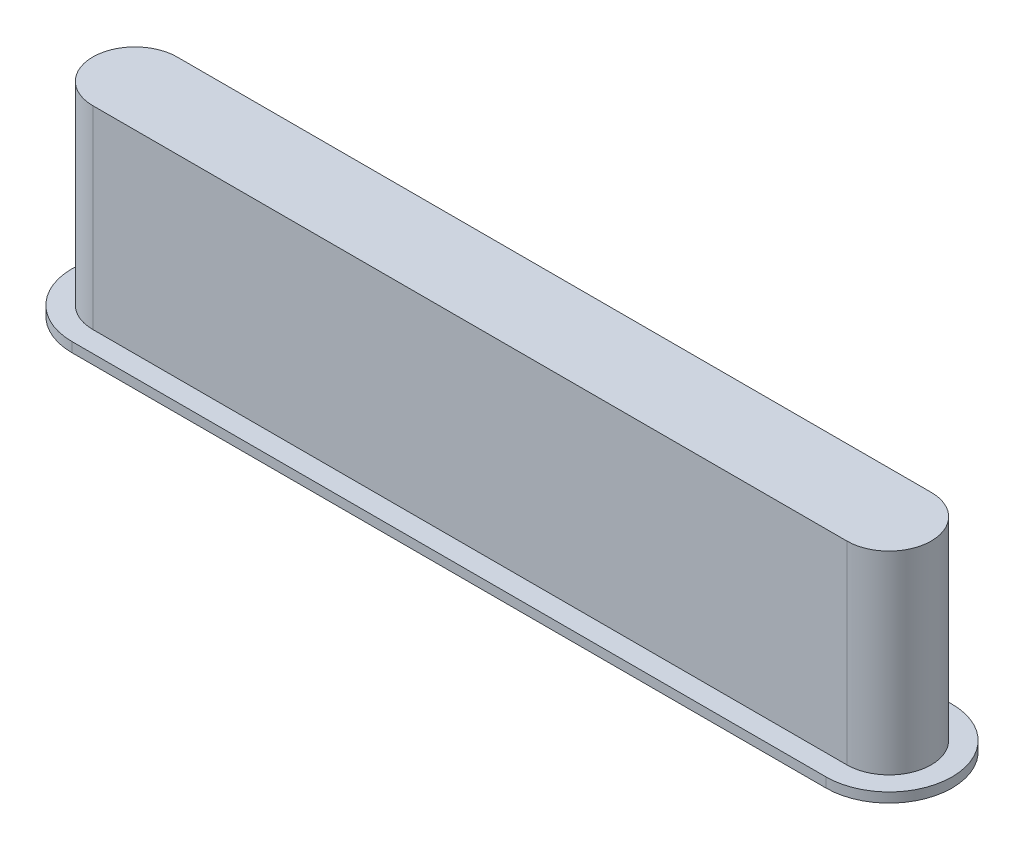
ISO-10303-21;
HEADER;
FILE_DESCRIPTION(('STEP AP214'),'2;1');
FILE_NAME('part.step','',(''),(''),'','','');
FILE_SCHEMA(('AUTOMOTIVE_DESIGN { 1 0 10303 214 1 1 1 1 }'));
ENDSEC;
DATA;
#1=APPLICATION_CONTEXT('core data for automotive mechanical design processes');
#2=APPLICATION_PROTOCOL_DEFINITION('international standard','automotive_design',2000,#1);
#3=PRODUCT_CONTEXT('',#1,'mechanical');
#4=PRODUCT('Part','Part','',(#3));
#5=PRODUCT_RELATED_PRODUCT_CATEGORY('part','',(#4));
#6=PRODUCT_DEFINITION_FORMATION('','',#4);
#7=PRODUCT_DEFINITION_CONTEXT('part definition',#1,'design');
#8=PRODUCT_DEFINITION('design','',#6,#7);
#9=PRODUCT_DEFINITION_SHAPE('','',#8);
#10=(LENGTH_UNIT() NAMED_UNIT(*) SI_UNIT(.MILLI.,.METRE.));
#11=(NAMED_UNIT(*) PLANE_ANGLE_UNIT() SI_UNIT($,.RADIAN.));
#12=(NAMED_UNIT(*) SI_UNIT($,.STERADIAN.) SOLID_ANGLE_UNIT());
#13=UNCERTAINTY_MEASURE_WITH_UNIT(LENGTH_MEASURE(1.E-05),#10,'distance_accuracy_value','');
#14=(GEOMETRIC_REPRESENTATION_CONTEXT(3) GLOBAL_UNCERTAINTY_ASSIGNED_CONTEXT((#13)) GLOBAL_UNIT_ASSIGNED_CONTEXT((#10,
#11,#12)) REPRESENTATION_CONTEXT('',''));
#15=CARTESIAN_POINT('',(0.,0.,0.));
#16=DIRECTION('',(0.,0.,1.));
#17=DIRECTION('',(1.,0.,0.));
#18=AXIS2_PLACEMENT_3D('',#15,#16,#17);
#19=CARTESIAN_POINT('',(-9.8806,5.08,0.));
#20=DIRECTION('',(0.,-1.,0.));
#21=DIRECTION('',(0.,0.,-1.));
#22=AXIS2_PLACEMENT_3D('',#19,#20,#21);
#23=CYLINDRICAL_SURFACE('',#22,1.1049);
#24=CARTESIAN_POINT('',(-9.8806,0.,0.));
#25=DIRECTION('',(0.,1.,0.));
#26=DIRECTION('',(0.,0.,1.));
#27=AXIS2_PLACEMENT_3D('',#24,#25,#26);
#28=CIRCLE('',#27,1.1049);
#29=CARTESIAN_POINT('',(-9.8806,0.,-1.1049));
#30=VERTEX_POINT('',#29);
#31=CARTESIAN_POINT('',(-9.8806,0.,1.1049));
#32=VERTEX_POINT('',#31);
#33=EDGE_CURVE('E138',#30,#32,#28,.T.);
#34=ORIENTED_EDGE('',*,*,#33,.T.);
#35=DIRECTION('',(0.,-1.,0.));
#36=VECTOR('',#35,1.);
#37=CARTESIAN_POINT('',(-9.8806,5.08,1.1049));
#38=LINE('',#37,#36);
#39=CARTESIAN_POINT('',(-9.8806,5.08,1.1049));
#40=VERTEX_POINT('',#39);
#41=EDGE_CURVE('E11',#40,#32,#38,.T.);
#42=ORIENTED_EDGE('',*,*,#41,.F.);
#43=CARTESIAN_POINT('',(-9.8806,5.08,0.));
#44=DIRECTION('',(0.,1.,0.));
#45=DIRECTION('',(0.,0.,1.));
#46=AXIS2_PLACEMENT_3D('',#43,#44,#45);
#47=CIRCLE('',#46,1.1049);
#48=CARTESIAN_POINT('',(-9.8806,5.08,-1.1049));
#49=VERTEX_POINT('',#48);
#50=EDGE_CURVE('E142',#49,#40,#47,.T.);
#51=ORIENTED_EDGE('',*,*,#50,.F.);
#52=DIRECTION('',(0.,-1.,0.));
#53=VECTOR('',#52,1.);
#54=CARTESIAN_POINT('',(-9.8806,5.08,-1.1049));
#55=LINE('',#54,#53);
#56=EDGE_CURVE('E150',#49,#30,#55,.T.);
#57=ORIENTED_EDGE('',*,*,#56,.T.);
#58=EDGE_LOOP('',(#34,#42,#51,#57));
#59=FACE_BOUND('',#58,.T.);
#60=ADVANCED_FACE('F39',(#59),#23,.T.);
#61=CARTESIAN_POINT('',(-9.8806,5.08,1.1049));
#62=DIRECTION('',(0.,0.,-1.));
#63=DIRECTION('',(-1.,0.,0.));
#64=AXIS2_PLACEMENT_3D('',#61,#62,#63);
#65=PLANE('',#64);
#66=DIRECTION('',(1.,0.,0.));
#67=VECTOR('',#66,1.);
#68=CARTESIAN_POINT('',(-9.8806,0.,1.1049));
#69=LINE('',#68,#67);
#70=CARTESIAN_POINT('',(9.8806,0.,1.1049));
#71=VERTEX_POINT('',#70);
#72=EDGE_CURVE('E153',#32,#71,#69,.T.);
#73=ORIENTED_EDGE('',*,*,#72,.T.);
#74=DIRECTION('',(0.,-1.,0.));
#75=VECTOR('',#74,1.);
#76=CARTESIAN_POINT('',(9.8806,5.08,1.1049));
#77=LINE('',#76,#75);
#78=CARTESIAN_POINT('',(9.8806,5.08,1.1049));
#79=VERTEX_POINT('',#78);
#80=EDGE_CURVE('E47',#79,#71,#77,.T.);
#81=ORIENTED_EDGE('',*,*,#80,.F.);
#82=DIRECTION('',(1.,0.,0.));
#83=VECTOR('',#82,1.);
#84=CARTESIAN_POINT('',(-9.8806,5.08,1.1049));
#85=LINE('',#84,#83);
#86=EDGE_CURVE('E144',#40,#79,#85,.T.);
#87=ORIENTED_EDGE('',*,*,#86,.F.);
#88=ORIENTED_EDGE('',*,*,#41,.T.);
#89=EDGE_LOOP('',(#73,#81,#87,#88));
#90=FACE_BOUND('',#89,.T.);
#91=ADVANCED_FACE('F173',(#90),#65,.F.);
#92=CARTESIAN_POINT('',(9.8806,5.08,0.));
#93=DIRECTION('',(0.,-1.,0.));
#94=DIRECTION('',(0.,0.,-1.));
#95=AXIS2_PLACEMENT_3D('',#92,#93,#94);
#96=CYLINDRICAL_SURFACE('',#95,1.1049);
#97=CARTESIAN_POINT('',(9.8806,0.,0.));
#98=DIRECTION('',(0.,1.,0.));
#99=DIRECTION('',(0.,0.,1.));
#100=AXIS2_PLACEMENT_3D('',#97,#98,#99);
#101=CIRCLE('',#100,1.1049);
#102=CARTESIAN_POINT('',(9.8806,0.,-1.1049));
#103=VERTEX_POINT('',#102);
#104=EDGE_CURVE('E156',#71,#103,#101,.T.);
#105=ORIENTED_EDGE('',*,*,#104,.T.);
#106=DIRECTION('',(0.,-1.,0.));
#107=VECTOR('',#106,1.);
#108=CARTESIAN_POINT('',(9.8806,5.08,-1.1049));
#109=LINE('',#108,#107);
#110=CARTESIAN_POINT('',(9.8806,5.08,-1.1049));
#111=VERTEX_POINT('',#110);
#112=EDGE_CURVE('E163',#111,#103,#109,.T.);
#113=ORIENTED_EDGE('',*,*,#112,.F.);
#114=CARTESIAN_POINT('',(9.8806,5.08,0.));
#115=DIRECTION('',(0.,1.,0.));
#116=DIRECTION('',(0.,0.,1.));
#117=AXIS2_PLACEMENT_3D('',#114,#115,#116);
#118=CIRCLE('',#117,1.1049);
#119=EDGE_CURVE('E147',#79,#111,#118,.T.);
#120=ORIENTED_EDGE('',*,*,#119,.F.);
#121=ORIENTED_EDGE('',*,*,#80,.T.);
#122=EDGE_LOOP('',(#105,#113,#120,#121));
#123=FACE_BOUND('',#122,.T.);
#124=ADVANCED_FACE('F169',(#123),#96,.T.);
#125=CARTESIAN_POINT('',(-9.8806,5.08,-1.1049));
#126=DIRECTION('',(0.,0.,1.));
#127=DIRECTION('',(1.,0.,0.));
#128=AXIS2_PLACEMENT_3D('',#125,#126,#127);
#129=PLANE('',#128);
#130=DIRECTION('',(-1.,0.,0.));
#131=VECTOR('',#130,1.);
#132=CARTESIAN_POINT('',(-9.8806,0.,-1.1049));
#133=LINE('',#132,#131);
#134=EDGE_CURVE('E145',#103,#30,#133,.T.);
#135=ORIENTED_EDGE('',*,*,#134,.T.);
#136=ORIENTED_EDGE('',*,*,#56,.F.);
#137=DIRECTION('',(-1.,0.,0.));
#138=VECTOR('',#137,1.);
#139=CARTESIAN_POINT('',(-9.8806,5.08,-1.1049));
#140=LINE('',#139,#138);
#141=EDGE_CURVE('E54',#111,#49,#140,.T.);
#142=ORIENTED_EDGE('',*,*,#141,.F.);
#143=ORIENTED_EDGE('',*,*,#112,.T.);
#144=EDGE_LOOP('',(#135,#136,#142,#143));
#145=FACE_BOUND('',#144,.T.);
#146=ADVANCED_FACE('F178',(#145),#129,.F.);
#147=CARTESIAN_POINT('',(-9.8806,5.08,0.));
#148=DIRECTION('',(0.,1.,0.));
#149=DIRECTION('',(0.,0.,1.));
#150=AXIS2_PLACEMENT_3D('',#147,#148,#149);
#151=PLANE('',#150);
#152=ORIENTED_EDGE('',*,*,#50,.T.);
#153=ORIENTED_EDGE('',*,*,#86,.T.);
#154=ORIENTED_EDGE('',*,*,#119,.T.);
#155=ORIENTED_EDGE('',*,*,#141,.T.);
#156=EDGE_LOOP('',(#152,#153,#154,#155));
#157=FACE_BOUND('',#156,.T.);
#158=ADVANCED_FACE('F181',(#157),#151,.T.);
#159=CARTESIAN_POINT('',(-9.8806,0.,0.));
#160=DIRECTION('',(0.,1.,0.));
#161=DIRECTION('',(0.,0.,1.));
#162=AXIS2_PLACEMENT_3D('',#159,#160,#161);
#163=PLANE('',#162);
#164=CARTESIAN_POINT('',(-9.8806,0.,0.));
#165=DIRECTION('',(0.,1.,0.));
#166=DIRECTION('',(0.,0.,1.));
#167=AXIS2_PLACEMENT_3D('',#164,#165,#166);
#168=CIRCLE('',#167,1.651);
#169=CARTESIAN_POINT('',(-9.8806,0.,-1.651));
#170=VERTEX_POINT('',#169);
#171=CARTESIAN_POINT('',(-9.8806,0.,1.651));
#172=VERTEX_POINT('',#171);
#173=EDGE_CURVE('E132',#170,#172,#168,.T.);
#174=ORIENTED_EDGE('',*,*,#173,.T.);
#175=DIRECTION('',(1.,0.,0.));
#176=VECTOR('',#175,1.);
#177=CARTESIAN_POINT('',(-9.8806,0.,1.651));
#178=LINE('',#177,#176);
#179=CARTESIAN_POINT('',(9.8806,0.,1.651));
#180=VERTEX_POINT('',#179);
#181=EDGE_CURVE('E104',#172,#180,#178,.T.);
#182=ORIENTED_EDGE('',*,*,#181,.T.);
#183=CARTESIAN_POINT('',(9.8806,0.,0.));
#184=DIRECTION('',(0.,1.,0.));
#185=DIRECTION('',(0.,0.,1.));
#186=AXIS2_PLACEMENT_3D('',#183,#184,#185);
#187=CIRCLE('',#186,1.651);
#188=CARTESIAN_POINT('',(9.8806,0.,-1.651));
#189=VERTEX_POINT('',#188);
#190=EDGE_CURVE('E127',#180,#189,#187,.T.);
#191=ORIENTED_EDGE('',*,*,#190,.T.);
#192=DIRECTION('',(-1.,0.,0.));
#193=VECTOR('',#192,1.);
#194=CARTESIAN_POINT('',(-9.8806,0.,-1.651));
#195=LINE('',#194,#193);
#196=EDGE_CURVE('E124',#189,#170,#195,.T.);
#197=ORIENTED_EDGE('',*,*,#196,.T.);
#198=EDGE_LOOP('',(#174,#182,#191,#197));
#199=FACE_BOUND('',#198,.T.);
#200=ORIENTED_EDGE('',*,*,#33,.F.);
#201=ORIENTED_EDGE('',*,*,#134,.F.);
#202=ORIENTED_EDGE('',*,*,#104,.F.);
#203=ORIENTED_EDGE('',*,*,#72,.F.);
#204=EDGE_LOOP('',(#200,#201,#202,#203));
#205=FACE_BOUND('',#204,.T.);
#206=ADVANCED_FACE('F176',(#199,#205),#163,.T.);
#207=CARTESIAN_POINT('',(-9.8806,-0.254,0.));
#208=DIRECTION('',(0.,1.,0.));
#209=DIRECTION('',(0.,0.,1.));
#210=AXIS2_PLACEMENT_3D('',#207,#208,#209);
#211=CYLINDRICAL_SURFACE('',#210,1.651);
#212=ORIENTED_EDGE('',*,*,#173,.F.);
#213=DIRECTION('',(0.,1.,0.));
#214=VECTOR('',#213,1.);
#215=CARTESIAN_POINT('',(-9.8806,-0.254,-1.651));
#216=LINE('',#215,#214);
#217=CARTESIAN_POINT('',(-9.8806,-0.254,-1.651));
#218=VERTEX_POINT('',#217);
#219=EDGE_CURVE('E123',#218,#170,#216,.T.);
#220=ORIENTED_EDGE('',*,*,#219,.F.);
#221=CARTESIAN_POINT('',(-9.8806,-0.254,0.));
#222=DIRECTION('',(0.,1.,0.));
#223=DIRECTION('',(0.,0.,1.));
#224=AXIS2_PLACEMENT_3D('',#221,#222,#223);
#225=CIRCLE('',#224,1.651);
#226=CARTESIAN_POINT('',(-9.8806,-0.254,1.651));
#227=VERTEX_POINT('',#226);
#228=EDGE_CURVE('E117',#218,#227,#225,.T.);
#229=ORIENTED_EDGE('',*,*,#228,.T.);
#230=DIRECTION('',(0.,1.,0.));
#231=VECTOR('',#230,1.);
#232=CARTESIAN_POINT('',(-9.8806,-0.254,1.651));
#233=LINE('',#232,#231);
#234=EDGE_CURVE('E99',#227,#172,#233,.T.);
#235=ORIENTED_EDGE('',*,*,#234,.T.);
#236=EDGE_LOOP('',(#212,#220,#229,#235));
#237=FACE_BOUND('',#236,.T.);
#238=ADVANCED_FACE('F122',(#237),#211,.T.);
#239=CARTESIAN_POINT('',(-9.8806,-0.254,-1.651));
#240=DIRECTION('',(0.,0.,-1.));
#241=DIRECTION('',(-1.,0.,0.));
#242=AXIS2_PLACEMENT_3D('',#239,#240,#241);
#243=PLANE('',#242);
#244=ORIENTED_EDGE('',*,*,#196,.F.);
#245=DIRECTION('',(0.,1.,0.));
#246=VECTOR('',#245,1.);
#247=CARTESIAN_POINT('',(9.8806,-0.254,-1.651));
#248=LINE('',#247,#246);
#249=CARTESIAN_POINT('',(9.8806,-0.254,-1.651));
#250=VERTEX_POINT('',#249);
#251=EDGE_CURVE('E139',#250,#189,#248,.T.);
#252=ORIENTED_EDGE('',*,*,#251,.F.);
#253=DIRECTION('',(-1.,0.,0.));
#254=VECTOR('',#253,1.);
#255=CARTESIAN_POINT('',(-9.8806,-0.254,-1.651));
#256=LINE('',#255,#254);
#257=EDGE_CURVE('E110',#250,#218,#256,.T.);
#258=ORIENTED_EDGE('',*,*,#257,.T.);
#259=ORIENTED_EDGE('',*,*,#219,.T.);
#260=EDGE_LOOP('',(#244,#252,#258,#259));
#261=FACE_BOUND('',#260,.T.);
#262=ADVANCED_FACE('F219',(#261),#243,.T.);
#263=CARTESIAN_POINT('',(9.8806,-0.254,0.));
#264=DIRECTION('',(0.,1.,0.));
#265=DIRECTION('',(0.,0.,1.));
#266=AXIS2_PLACEMENT_3D('',#263,#264,#265);
#267=CYLINDRICAL_SURFACE('',#266,1.651);
#268=ORIENTED_EDGE('',*,*,#190,.F.);
#269=DIRECTION('',(0.,1.,0.));
#270=VECTOR('',#269,1.);
#271=CARTESIAN_POINT('',(9.8806,-0.254,1.651));
#272=LINE('',#271,#270);
#273=CARTESIAN_POINT('',(9.8806,-0.254,1.651));
#274=VERTEX_POINT('',#273);
#275=EDGE_CURVE('E109',#274,#180,#272,.T.);
#276=ORIENTED_EDGE('',*,*,#275,.F.);
#277=CARTESIAN_POINT('',(9.8806,-0.254,0.));
#278=DIRECTION('',(0.,1.,0.));
#279=DIRECTION('',(0.,0.,1.));
#280=AXIS2_PLACEMENT_3D('',#277,#278,#279);
#281=CIRCLE('',#280,1.651);
#282=EDGE_CURVE('E120',#274,#250,#281,.T.);
#283=ORIENTED_EDGE('',*,*,#282,.T.);
#284=ORIENTED_EDGE('',*,*,#251,.T.);
#285=EDGE_LOOP('',(#268,#276,#283,#284));
#286=FACE_BOUND('',#285,.T.);
#287=ADVANCED_FACE('F226',(#286),#267,.T.);
#288=CARTESIAN_POINT('',(-9.8806,-0.254,1.651));
#289=DIRECTION('',(0.,0.,1.));
#290=DIRECTION('',(1.,0.,0.));
#291=AXIS2_PLACEMENT_3D('',#288,#289,#290);
#292=PLANE('',#291);
#293=ORIENTED_EDGE('',*,*,#181,.F.);
#294=ORIENTED_EDGE('',*,*,#234,.F.);
#295=DIRECTION('',(1.,0.,0.));
#296=VECTOR('',#295,1.);
#297=CARTESIAN_POINT('',(-9.8806,-0.254,1.651));
#298=LINE('',#297,#296);
#299=EDGE_CURVE('E102',#227,#274,#298,.T.);
#300=ORIENTED_EDGE('',*,*,#299,.T.);
#301=ORIENTED_EDGE('',*,*,#275,.T.);
#302=EDGE_LOOP('',(#293,#294,#300,#301));
#303=FACE_BOUND('',#302,.T.);
#304=ADVANCED_FACE('F101',(#303),#292,.T.);
#305=CARTESIAN_POINT('',(-9.8806,-0.254,0.));
#306=DIRECTION('',(0.,1.,0.));
#307=DIRECTION('',(0.,0.,1.));
#308=AXIS2_PLACEMENT_3D('',#305,#306,#307);
#309=PLANE('',#308);
#310=ORIENTED_EDGE('',*,*,#228,.F.);
#311=ORIENTED_EDGE('',*,*,#257,.F.);
#312=ORIENTED_EDGE('',*,*,#282,.F.);
#313=ORIENTED_EDGE('',*,*,#299,.F.);
#314=EDGE_LOOP('',(#310,#311,#312,#313));
#315=FACE_BOUND('',#314,.T.);
#316=ADVANCED_FACE('F115',(#315),#309,.F.);
#317=CLOSED_SHELL('',(#60,#91,#124,#146,#158,#206,#238,#262,#287,#304,#316));
#318=MANIFOLD_SOLID_BREP('B2',#317);
#319=ADVANCED_BREP_SHAPE_REPRESENTATION('',(#18,#318),#14);
#320=SHAPE_DEFINITION_REPRESENTATION(#9,#319);
ENDSEC;
END-ISO-10303-21;
